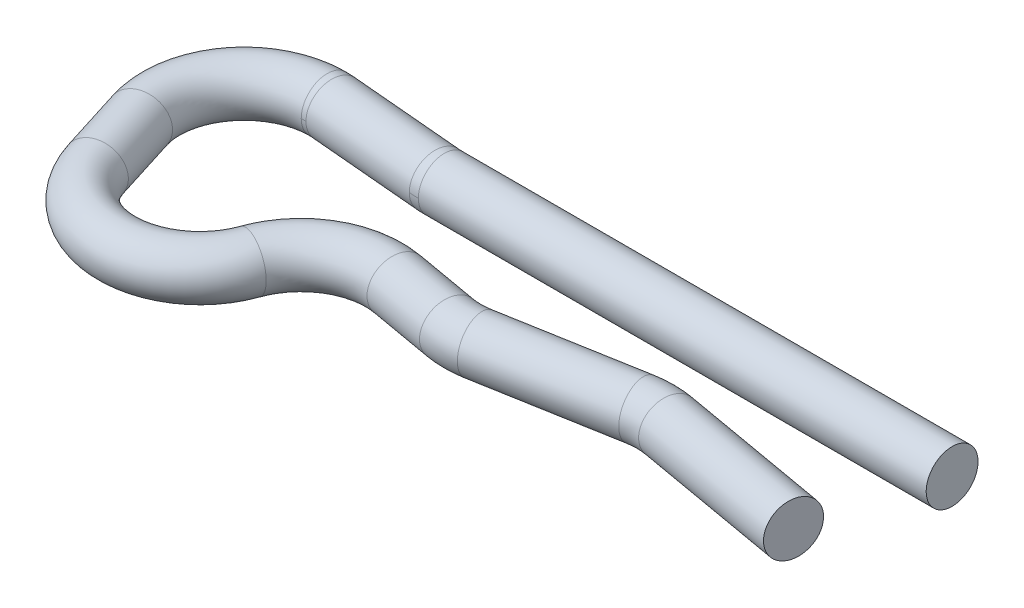
ISO-10303-21;
HEADER;
FILE_DESCRIPTION(('STEP AP214'),'2;1');
FILE_NAME('part.step','',(''),(''),'','','');
FILE_SCHEMA(('AUTOMOTIVE_DESIGN { 1 0 10303 214 1 1 1 1 }'));
ENDSEC;
DATA;
#1=APPLICATION_CONTEXT('core data for automotive mechanical design processes');
#2=APPLICATION_PROTOCOL_DEFINITION('international standard','automotive_design',2000,#1);
#3=PRODUCT_CONTEXT('',#1,'mechanical');
#4=PRODUCT('Part','Part','',(#3));
#5=PRODUCT_RELATED_PRODUCT_CATEGORY('part','',(#4));
#6=PRODUCT_DEFINITION_FORMATION('','',#4);
#7=PRODUCT_DEFINITION_CONTEXT('part definition',#1,'design');
#8=PRODUCT_DEFINITION('design','',#6,#7);
#9=PRODUCT_DEFINITION_SHAPE('','',#8);
#10=(LENGTH_UNIT() NAMED_UNIT(*) SI_UNIT(.MILLI.,.METRE.));
#11=(NAMED_UNIT(*) PLANE_ANGLE_UNIT() SI_UNIT($,.RADIAN.));
#12=(NAMED_UNIT(*) SI_UNIT($,.STERADIAN.) SOLID_ANGLE_UNIT());
#13=UNCERTAINTY_MEASURE_WITH_UNIT(LENGTH_MEASURE(1.E-05),#10,'distance_accuracy_value','');
#14=(GEOMETRIC_REPRESENTATION_CONTEXT(3) GLOBAL_UNCERTAINTY_ASSIGNED_CONTEXT((#13)) GLOBAL_UNIT_ASSIGNED_CONTEXT((#10,
#11,#12)) REPRESENTATION_CONTEXT('',''));
#15=CARTESIAN_POINT('',(0.,0.,0.));
#16=DIRECTION('',(0.,0.,1.));
#17=DIRECTION('',(1.,0.,0.));
#18=AXIS2_PLACEMENT_3D('',#15,#16,#17);
#19=CARTESIAN_POINT('',(-45.546720168648,-12.5000000003638,159.218937459353));
#20=DIRECTION('',(7.87396112827103E-12,-1.,-1.83559952871063E-10));
#21=DIRECTION('',(0.,1.83559952871063E-10,-1.));
#22=AXIS2_PLACEMENT_3D('',#19,#20,#21);
#23=TOROIDAL_SURFACE('',#22,2.00000000150892,0.625000000000209);
#24=CARTESIAN_POINT('',(-45.5467201685893,-12.4999999999966,159.218937457845));
#25=DIRECTION('',(0.,-1.,0.));
#26=DIRECTION('',(0.,0.,-1.));
#27=AXIS2_PLACEMENT_3D('',#24,#25,#26);
#28=CIRCLE('',#27,1.37500000000002);
#29=CARTESIAN_POINT('',(-45.5467201685893,-12.4999999999966,157.843937457845));
#30=VERTEX_POINT('',#29);
#31=CARTESIAN_POINT('',(-45.4268810223112,-12.4999999999966,157.849169747969));
#32=VERTEX_POINT('',#31);
#33=EDGE_CURVE('E34',#30,#32,#28,.T.);
#34=ORIENTED_EDGE('',*,*,#33,.F.);
#35=CARTESIAN_POINT('',(-45.5467201685893,-12.4999999999966,157.218937457845));
#36=DIRECTION('',(1.,0.,0.));
#37=DIRECTION('',(0.,1.,0.));
#38=AXIS2_PLACEMENT_3D('',#35,#36,#37);
#39=CIRCLE('',#38,0.624999999999987);
#40=CARTESIAN_POINT('',(-45.5467201685893,-12.4999999999966,156.593937457845));
#41=VERTEX_POINT('',#40);
#42=EDGE_CURVE('E11',#30,#41,#39,.T.);
#43=ORIENTED_EDGE('',*,*,#42,.T.);
#44=CARTESIAN_POINT('',(-45.5467201685893,-12.4999999999966,159.218937457845));
#45=DIRECTION('',(0.,-1.,0.));
#46=DIRECTION('',(0.,0.,-1.));
#47=AXIS2_PLACEMENT_3D('',#44,#45,#46);
#48=CIRCLE('',#47,2.62499999999999);
#49=CARTESIAN_POINT('',(-45.3179363438767,-12.4999999999966,156.603926375354));
#50=VERTEX_POINT('',#49);
#51=EDGE_CURVE('E26',#41,#50,#48,.T.);
#52=ORIENTED_EDGE('',*,*,#51,.T.);
#53=CARTESIAN_POINT('',(-45.372408683094,-12.4999999999966,157.226548061661));
#54=DIRECTION('',(0.996194698091746,0.,0.0871557427476577));
#55=DIRECTION('',(0.,-1.,0.));
#56=AXIS2_PLACEMENT_3D('',#53,#54,#55);
#57=CIRCLE('',#56,0.624999999999993);
#58=EDGE_CURVE('E101',#32,#50,#57,.T.);
#59=ORIENTED_EDGE('',*,*,#58,.F.);
#60=EDGE_LOOP('',(#34,#43,#52,#59));
#61=FACE_BOUND('',#60,.T.);
#62=ADVANCED_FACE('F16',(#61),#23,.T.);
#63=CARTESIAN_POINT('',(-45.5467201688116,-12.5000000015029,159.218937463478));
#64=DIRECTION('',(3.27591437518132E-11,-1.,-7.52985718310401E-10));
#65=DIRECTION('',(0.,7.52985718310401E-10,-1.));
#66=AXIS2_PLACEMENT_3D('',#63,#64,#65);
#67=TOROIDAL_SURFACE('',#66,2.00000000563584,0.624999999999183);
#68=ORIENTED_EDGE('',*,*,#51,.F.);
#69=CARTESIAN_POINT('',(-45.5467201685893,-12.4999999999966,157.218937457845));
#70=DIRECTION('',(1.,0.,0.));
#71=DIRECTION('',(0.,1.,0.));
#72=AXIS2_PLACEMENT_3D('',#69,#70,#71);
#73=CIRCLE('',#72,0.624999999999987);
#74=EDGE_CURVE('E109',#41,#30,#73,.T.);
#75=ORIENTED_EDGE('',*,*,#74,.T.);
#76=ORIENTED_EDGE('',*,*,#33,.T.);
#77=CARTESIAN_POINT('',(-45.372408683094,-12.4999999999966,157.226548061661));
#78=DIRECTION('',(0.996194698091746,0.,0.0871557427476577));
#79=DIRECTION('',(0.,-1.,0.));
#80=AXIS2_PLACEMENT_3D('',#77,#78,#79);
#81=CIRCLE('',#80,0.624999999999993);
#82=EDGE_CURVE('E105',#50,#32,#81,.T.);
#83=ORIENTED_EDGE('',*,*,#82,.F.);
#84=EDGE_LOOP('',(#68,#75,#76,#83));
#85=FACE_BOUND('',#84,.T.);
#86=ADVANCED_FACE('F117',(#85),#67,.T.);
#87=CARTESIAN_POINT('',(-42.4708141889227,-12.500000002278,155.472765019879));
#88=DIRECTION('',(4.99192310586111E-11,1.,-1.14040538910799E-09));
#89=DIRECTION('',(-0.999043326616076,0.,-0.0437313565292076));
#90=AXIS2_PLACEMENT_3D('',#87,#88,#89);
#91=TOROIDAL_SURFACE('',#90,1.99999999111517,0.625000000001191);
#92=CARTESIAN_POINT('',(-42.6451256739924,-12.4999999999966,157.465154407185));
#93=DIRECTION('',(0.996194698091745,0.,0.0871557427476617));
#94=DIRECTION('',(0.,-1.,0.));
#95=AXIS2_PLACEMENT_3D('',#92,#93,#94);
#96=CIRCLE('',#95,0.624999999999993);
#97=CARTESIAN_POINT('',(-42.6995980132096,-12.4999999999966,158.087776093492));
#98=VERTEX_POINT('',#97);
#99=CARTESIAN_POINT('',(-42.5906533347751,-12.4999999999966,156.842532720877));
#100=VERTEX_POINT('',#99);
#101=EDGE_CURVE('E104',#98,#100,#96,.T.);
#102=ORIENTED_EDGE('',*,*,#101,.T.);
#103=CARTESIAN_POINT('',(-42.470814188497,-12.4999999999966,155.472765011001));
#104=DIRECTION('',(0.,1.,0.));
#105=DIRECTION('',(1.,0.,0.));
#106=AXIS2_PLACEMENT_3D('',#103,#104,#105);
#107=CIRCLE('',#106,1.37500000000002);
#108=CARTESIAN_POINT('',(-42.470814188497,-12.4999999999966,156.847765011001));
#109=VERTEX_POINT('',#108);
#110=EDGE_CURVE('E70',#100,#109,#107,.T.);
#111=ORIENTED_EDGE('',*,*,#110,.T.);
#112=CARTESIAN_POINT('',(-42.470814188497,-12.4999999999966,157.472765011001));
#113=DIRECTION('',(1.,0.,0.));
#114=DIRECTION('',(0.,1.,0.));
#115=AXIS2_PLACEMENT_3D('',#112,#113,#114);
#116=CIRCLE('',#115,0.624999999999987);
#117=CARTESIAN_POINT('',(-42.470814188497,-12.4999999999966,158.097765011001));
#118=VERTEX_POINT('',#117);
#119=EDGE_CURVE('E54',#118,#109,#116,.T.);
#120=ORIENTED_EDGE('',*,*,#119,.F.);
#121=CARTESIAN_POINT('',(-42.470814188497,-12.4999999999966,155.472765011001));
#122=DIRECTION('',(0.,1.,0.));
#123=DIRECTION('',(1.,0.,0.));
#124=AXIS2_PLACEMENT_3D('',#121,#122,#123);
#125=CIRCLE('',#124,2.62499999999999);
#126=EDGE_CURVE('E60',#98,#118,#125,.T.);
#127=ORIENTED_EDGE('',*,*,#126,.F.);
#128=EDGE_LOOP('',(#102,#111,#120,#127));
#129=FACE_BOUND('',#128,.T.);
#130=ADVANCED_FACE('F69',(#129),#91,.T.);
#131=CARTESIAN_POINT('',(-42.6451256739924,-12.4999999999966,157.465154407185));
#132=DIRECTION('',(0.996194698091746,0.,0.0871557427476577));
#133=DIRECTION('',(0.,-1.,0.));
#134=AXIS2_PLACEMENT_3D('',#131,#132,#133);
#135=CYLINDRICAL_SURFACE('',#134,0.624999999999993);
#136=ORIENTED_EDGE('',*,*,#82,.T.);
#137=ORIENTED_EDGE('',*,*,#58,.T.);
#138=EDGE_LOOP('',(#136,#137));
#139=FACE_BOUND('',#138,.T.);
#140=ORIENTED_EDGE('',*,*,#101,.F.);
#141=CARTESIAN_POINT('',(-42.6451256739924,-12.4999999999966,157.465154407185));
#142=DIRECTION('',(0.996194698091745,0.,0.0871557427476617));
#143=DIRECTION('',(0.,-1.,0.));
#144=AXIS2_PLACEMENT_3D('',#141,#142,#143);
#145=CIRCLE('',#144,0.624999999999993);
#146=EDGE_CURVE('E64',#100,#98,#145,.T.);
#147=ORIENTED_EDGE('',*,*,#146,.F.);
#148=EDGE_LOOP('',(#140,#147));
#149=FACE_BOUND('',#148,.T.);
#150=ADVANCED_FACE('F120',(#139,#149),#135,.T.);
#151=CARTESIAN_POINT('',(-45.5467201685896,-12.4999999999966,159.218937457845));
#152=DIRECTION('',(0.,-1.,0.));
#153=DIRECTION('',(0.,0.,-1.));
#154=AXIS2_PLACEMENT_3D('',#151,#152,#153);
#155=TOROIDAL_SURFACE('',#154,1.99999999999974,0.625000000000017);
#156=ORIENTED_EDGE('',*,*,#74,.F.);
#157=ORIENTED_EDGE('',*,*,#42,.F.);
#158=EDGE_LOOP('',(#156,#157));
#159=FACE_BOUND('',#158,.T.);
#160=CARTESIAN_POINT('',(-47.454623892858,-12.4999999999966,159.818856934876));
#161=DIRECTION('',(-0.299959738515608,0.,-0.953951862134378));
#162=DIRECTION('',(-0.953951862134378,0.,0.299959738515608));
#163=AXIS2_PLACEMENT_3D('',#160,#161,#162);
#164=CIRCLE('',#163,0.625000000000001);
#165=CARTESIAN_POINT('',(-48.050843806692,-12.4999999999966,160.006331771448));
#166=VERTEX_POINT('',#165);
#167=EDGE_CURVE('E98',#166,#166,#164,.T.);
#168=ORIENTED_EDGE('',*,*,#167,.T.);
#169=EDGE_LOOP('',(#168));
#170=FACE_BOUND('',#169,.T.);
#171=ADVANCED_FACE('F123',(#159,#170),#155,.T.);
#172=CARTESIAN_POINT('',(-47.454623892858,-12.4999999999966,159.818856934876));
#173=DIRECTION('',(-0.299959738515604,0.,-0.95395186213438));
#174=DIRECTION('',(-0.95395186213438,0.,0.299959738515604));
#175=AXIS2_PLACEMENT_3D('',#172,#173,#174);
#176=CYLINDRICAL_SURFACE('',#175,0.625000000000001);
#177=CARTESIAN_POINT('',(-46.9660397985828,-12.4999999999966,161.372684488032));
#178=DIRECTION('',(-0.299959738515604,0.,-0.95395186213438));
#179=DIRECTION('',(-0.95395186213438,0.,0.299959738515604));
#180=AXIS2_PLACEMENT_3D('',#177,#178,#179);
#181=CIRCLE('',#180,0.625000000000001);
#182=CARTESIAN_POINT('',(-47.5622597124169,-12.4999999999966,161.560159324605));
#183=VERTEX_POINT('',#182);
#184=EDGE_CURVE('E95',#183,#183,#181,.T.);
#185=ORIENTED_EDGE('',*,*,#184,.T.);
#186=EDGE_LOOP('',(#185));
#187=FACE_BOUND('',#186,.T.);
#188=ORIENTED_EDGE('',*,*,#167,.F.);
#189=EDGE_LOOP('',(#188));
#190=FACE_BOUND('',#189,.T.);
#191=ADVANCED_FACE('F126',(#187,#190),#176,.T.);
#192=CARTESIAN_POINT('',(-45.0581360743141,-12.4999999999966,160.772765011001));
#193=DIRECTION('',(0.,-1.,0.));
#194=DIRECTION('',(-1.,0.,0.));
#195=AXIS2_PLACEMENT_3D('',#192,#193,#194);
#196=TOROIDAL_SURFACE('',#195,2.00000000000015,0.624999999999956);
#197=CARTESIAN_POINT('',(-43.1732728550762,-12.4999999999966,161.441562921258));
#198=DIRECTION('',(-0.334398955128511,0.,0.942431609618947));
#199=DIRECTION('',(0.,1.,0.));
#200=AXIS2_PLACEMENT_3D('',#197,#198,#199);
#201=CIRCLE('',#200,0.624999999999995);
#202=CARTESIAN_POINT('',(-42.5842530990643,-12.4999999999966,161.650562268214));
#203=VERTEX_POINT('',#202);
#204=EDGE_CURVE('E92',#203,#203,#201,.T.);
#205=CARTESIAN_POINT('',(-45.0581360743141,-12.4999999999966,160.772765011001));
#206=DIRECTION('',(0.,-1.,0.));
#207=DIRECTION('',(-1.,0.,0.));
#208=AXIS2_PLACEMENT_3D('',#205,#206,#207);
#209=CIRCLE('',#208,2.62500000000011);
#210=EDGE_CURVE('',#203,#183,#209,.T.);
#211=ORIENTED_EDGE('',*,*,#204,.T.);
#212=ORIENTED_EDGE('',*,*,#184,.F.);
#213=ORIENTED_EDGE('',*,*,#210,.T.);
#214=ORIENTED_EDGE('',*,*,#210,.F.);
#215=EDGE_LOOP('',(#211,#213,#212,#214));
#216=FACE_BOUND('',#215,.T.);
#217=ADVANCED_FACE('F131',(#216),#196,.T.);
#218=CARTESIAN_POINT('',(-41.2884096358381,-12.4999999999969,162.110360831516));
#219=DIRECTION('',(0.,1.,1.43295246764835E-13));
#220=DIRECTION('',(1.,0.,0.));
#221=AXIS2_PLACEMENT_3D('',#218,#219,#220);
#222=TOROIDAL_SURFACE('',#221,2.00000000000037,0.62500000000002);
#223=CARTESIAN_POINT('',(-40.9411132805044,-12.4999999999966,160.140745325491));
#224=DIRECTION('',(-0.984807753012208,0.,-0.173648177666931));
#225=DIRECTION('',(-0.173648177666931,0.,0.984807753012208));
#226=AXIS2_PLACEMENT_3D('',#223,#224,#225);
#227=CIRCLE('',#226,0.625000000000006);
#228=CARTESIAN_POINT('',(-41.0496433915462,-12.4999999999966,160.756250171123));
#229=VERTEX_POINT('',#228);
#230=EDGE_CURVE('E89',#229,#229,#227,.T.);
#231=ORIENTED_EDGE('',*,*,#230,.T.);
#232=EDGE_LOOP('',(#231));
#233=FACE_BOUND('',#232,.T.);
#234=ORIENTED_EDGE('',*,*,#204,.F.);
#235=EDGE_LOOP('',(#234));
#236=FACE_BOUND('',#235,.T.);
#237=ADVANCED_FACE('F138',(#233,#236),#222,.T.);
#238=CARTESIAN_POINT('',(-40.9411132805044,-12.4999999999966,160.140745325491));
#239=DIRECTION('',(-0.984807753012208,0.,-0.173648177666931));
#240=DIRECTION('',(-0.173648177666931,0.,0.984807753012208));
#241=AXIS2_PLACEMENT_3D('',#238,#239,#240);
#242=CYLINDRICAL_SURFACE('',#241,0.625000000000006);
#243=CARTESIAN_POINT('',(-39.4054324296479,-12.4999999999966,160.411527293254));
#244=DIRECTION('',(-0.984807753012208,0.,-0.173648177666931));
#245=DIRECTION('',(-0.173648177666931,0.,0.984807753012208));
#246=AXIS2_PLACEMENT_3D('',#243,#244,#245);
#247=CIRCLE('',#246,0.625000000000006);
#248=CARTESIAN_POINT('',(-39.5139625406869,-12.4999999999937,161.027032138888));
#249=VERTEX_POINT('',#248);
#250=EDGE_CURVE('E86',#249,#249,#247,.T.);
#251=ORIENTED_EDGE('',*,*,#250,.T.);
#252=EDGE_LOOP('',(#251));
#253=FACE_BOUND('',#252,.T.);
#254=ORIENTED_EDGE('',*,*,#230,.F.);
#255=EDGE_LOOP('',(#254));
#256=FACE_BOUND('',#255,.T.);
#257=ADVANCED_FACE('F154',(#253,#256),#242,.T.);
#258=CARTESIAN_POINT('',(-39.058136074315,-12.5000000000058,158.44191178718));
#259=DIRECTION('',(0.,-1.,4.70401178579826E-12));
#260=DIRECTION('',(-1.,0.,0.));
#261=AXIS2_PLACEMENT_3D('',#258,#259,#260);
#262=TOROIDAL_SURFACE('',#261,2.00000000004957,0.624999999999852);
#263=CARTESIAN_POINT('',(-38.7108397189802,-12.4999999999966,160.411527293254));
#264=DIRECTION('',(-0.984807753012209,0.,0.173648177666923));
#265=DIRECTION('',(0.,1.,0.));
#266=AXIS2_PLACEMENT_3D('',#263,#264,#265);
#267=CIRCLE('',#266,0.625000000000005);
#268=CARTESIAN_POINT('',(-38.6023096079407,-12.4999999999937,161.027032138887));
#269=VERTEX_POINT('',#268);
#270=EDGE_CURVE('E83',#269,#269,#267,.T.);
#271=CARTESIAN_POINT('',(-39.058136074315,-12.5000000000058,158.44191178718));
#272=DIRECTION('',(0.,-1.,4.70401178579826E-12));
#273=DIRECTION('',(-1.,0.,0.));
#274=AXIS2_PLACEMENT_3D('',#271,#272,#273);
#275=CIRCLE('',#274,2.62500000004942);
#276=EDGE_CURVE('',#269,#249,#275,.T.);
#277=ORIENTED_EDGE('',*,*,#270,.T.);
#278=ORIENTED_EDGE('',*,*,#250,.F.);
#279=ORIENTED_EDGE('',*,*,#276,.T.);
#280=ORIENTED_EDGE('',*,*,#276,.F.);
#281=EDGE_LOOP('',(#277,#279,#278,#280));
#282=FACE_BOUND('',#281,.T.);
#283=ADVANCED_FACE('F156',(#282),#262,.T.);
#284=CARTESIAN_POINT('',(-38.7108397189802,-12.4999999999966,160.411527293254));
#285=DIRECTION('',(-0.984807753012208,0.,0.17364817766693));
#286=DIRECTION('',(0.,1.,0.));
#287=AXIS2_PLACEMENT_3D('',#284,#285,#286);
#288=CYLINDRICAL_SURFACE('',#287,0.625000000000006);
#289=CARTESIAN_POINT('',(-35.4054324296479,-12.4999999999966,159.828694805914));
#290=DIRECTION('',(-0.984807753012208,0.,0.17364817766693));
#291=DIRECTION('',(0.,1.,0.));
#292=AXIS2_PLACEMENT_3D('',#289,#290,#291);
#293=CIRCLE('',#292,0.625000000000006);
#294=CARTESIAN_POINT('',(-35.5139625406926,-12.4999999999926,159.213189960283));
#295=VERTEX_POINT('',#294);
#296=EDGE_CURVE('E80',#295,#295,#293,.T.);
#297=ORIENTED_EDGE('',*,*,#296,.T.);
#298=EDGE_LOOP('',(#297));
#299=FACE_BOUND('',#298,.T.);
#300=ORIENTED_EDGE('',*,*,#270,.F.);
#301=EDGE_LOOP('',(#300));
#302=FACE_BOUND('',#301,.T.);
#303=ADVANCED_FACE('F159',(#299,#302),#288,.T.);
#304=CARTESIAN_POINT('',(-35.0581360743133,-12.5000000000094,161.798310311889));
#305=DIRECTION('',(0.,1.,6.47985280748501E-12));
#306=DIRECTION('',(1.,0.,0.));
#307=AXIS2_PLACEMENT_3D('',#304,#305,#306);
#308=TOROIDAL_SURFACE('',#307,1.99999999995016,0.625000000000149);
#309=CARTESIAN_POINT('',(-34.7108397189802,-12.4999999999966,159.828694805914));
#310=DIRECTION('',(-0.984807753012209,0.,-0.173648177666924));
#311=DIRECTION('',(-0.173648177666924,0.,0.984807753012209));
#312=AXIS2_PLACEMENT_3D('',#309,#310,#311);
#313=CIRCLE('',#312,0.625000000000005);
#314=CARTESIAN_POINT('',(-34.602309607936,-12.4999999999926,159.213189960282));
#315=VERTEX_POINT('',#314);
#316=EDGE_CURVE('E75',#315,#315,#313,.T.);
#317=CARTESIAN_POINT('',(-35.0581360743133,-12.5000000000094,161.798310311889));
#318=DIRECTION('',(0.,1.,6.47985280748501E-12));
#319=DIRECTION('',(1.,0.,0.));
#320=AXIS2_PLACEMENT_3D('',#317,#318,#319);
#321=CIRCLE('',#320,2.62499999995031);
#322=EDGE_CURVE('',#315,#295,#321,.T.);
#323=ORIENTED_EDGE('',*,*,#316,.T.);
#324=ORIENTED_EDGE('',*,*,#296,.F.);
#325=ORIENTED_EDGE('',*,*,#322,.T.);
#326=ORIENTED_EDGE('',*,*,#322,.F.);
#327=EDGE_LOOP('',(#323,#325,#324,#326));
#328=FACE_BOUND('',#327,.T.);
#329=ADVANCED_FACE('F161',(#328),#308,.T.);
#330=CARTESIAN_POINT('',(-34.7108397189802,-12.4999999999966,159.828694805914));
#331=DIRECTION('',(-0.984807753012208,0.,-0.17364817766693));
#332=DIRECTION('',(-0.17364817766693,0.,0.984807753012208));
#333=AXIS2_PLACEMENT_3D('',#330,#331,#332);
#334=CYLINDRICAL_SURFACE('',#333,0.625000000000006);
#335=CARTESIAN_POINT('',(-31.0581360743141,-12.4999999999966,160.472765011001));
#336=DIRECTION('',(-0.984807753012208,0.,-0.17364817766693));
#337=DIRECTION('',(-0.17364817766693,0.,0.984807753012208));
#338=AXIS2_PLACEMENT_3D('',#335,#336,#337);
#339=CIRCLE('',#338,0.625000000000006);
#340=CARTESIAN_POINT('',(-31.1666661853559,-12.4999999999966,161.088269856634));
#341=VERTEX_POINT('',#340);
#342=EDGE_CURVE('E73',#341,#341,#339,.T.);
#343=ORIENTED_EDGE('',*,*,#342,.T.);
#344=EDGE_LOOP('',(#343));
#345=FACE_BOUND('',#344,.T.);
#346=ORIENTED_EDGE('',*,*,#316,.F.);
#347=EDGE_LOOP('',(#346));
#348=FACE_BOUND('',#347,.T.);
#349=ADVANCED_FACE('F164',(#345,#348),#334,.T.);
#350=CARTESIAN_POINT('',(-28.5581360743141,-12.4999999999966,157.472765011001));
#351=DIRECTION('',(1.,0.,0.));
#352=DIRECTION('',(0.,1.,0.));
#353=AXIS2_PLACEMENT_3D('',#350,#351,#352);
#354=CYLINDRICAL_SURFACE('',#353,0.624999999999987);
#355=CARTESIAN_POINT('',(-42.470814188497,-12.4999999999966,157.472765011001));
#356=DIRECTION('',(1.,0.,0.));
#357=DIRECTION('',(0.,1.,0.));
#358=AXIS2_PLACEMENT_3D('',#355,#356,#357);
#359=CIRCLE('',#358,0.624999999999987);
#360=EDGE_CURVE('E62',#109,#118,#359,.T.);
#361=ORIENTED_EDGE('',*,*,#360,.T.);
#362=ORIENTED_EDGE('',*,*,#119,.T.);
#363=EDGE_LOOP('',(#361,#362));
#364=FACE_BOUND('',#363,.T.);
#365=CARTESIAN_POINT('',(-30.2377523917796,-12.4999999999966,157.472765011001));
#366=DIRECTION('',(-1.,0.,0.));
#367=DIRECTION('',(0.,0.,1.));
#368=AXIS2_PLACEMENT_3D('',#365,#366,#367);
#369=CIRCLE('',#368,0.624999999999987);
#370=CARTESIAN_POINT('',(-30.2377523917796,-12.4999999999966,158.097765011001));
#371=VERTEX_POINT('',#370);
#372=EDGE_CURVE('E20',#371,#371,#369,.T.);
#373=ORIENTED_EDGE('',*,*,#372,.T.);
#374=EDGE_LOOP('',(#373));
#375=FACE_BOUND('',#374,.T.);
#376=ADVANCED_FACE('F18',(#364,#375),#354,.T.);
#377=CARTESIAN_POINT('',(-31.0581360743141,-12.4999999999966,160.472765011001));
#378=DIRECTION('',(-0.984807753012208,0.,-0.17364817766693));
#379=DIRECTION('',(-0.17364817766693,0.,0.984807753012208));
#380=AXIS2_PLACEMENT_3D('',#377,#378,#379);
#381=PLANE('',#380);
#382=ORIENTED_EDGE('',*,*,#342,.F.);
#383=EDGE_LOOP('',(#382));
#384=FACE_BOUND('',#383,.T.);
#385=ADVANCED_FACE('F166',(#384),#381,.F.);
#386=CARTESIAN_POINT('',(-42.4708141885707,-12.500000000392,155.472765012551));
#387=DIRECTION('',(8.6922644742758E-12,1.,-1.97653732100154E-10));
#388=DIRECTION('',(-0.999034401807047,0.,-0.0439347698985342));
#389=AXIS2_PLACEMENT_3D('',#386,#387,#388);
#390=TOROIDAL_SURFACE('',#389,1.99999999844866,0.624999999999736);
#391=ORIENTED_EDGE('',*,*,#110,.F.);
#392=ORIENTED_EDGE('',*,*,#146,.T.);
#393=ORIENTED_EDGE('',*,*,#126,.T.);
#394=ORIENTED_EDGE('',*,*,#360,.F.);
#395=EDGE_LOOP('',(#391,#392,#393,#394));
#396=FACE_BOUND('',#395,.T.);
#397=ADVANCED_FACE('F61',(#396),#390,.T.);
#398=CARTESIAN_POINT('',(-30.2377523917796,-12.5946020455283,163.397765011001));
#399=DIRECTION('',(1.,0.,0.));
#400=DIRECTION('',(0.,0.,-1.));
#401=AXIS2_PLACEMENT_3D('',#398,#399,#400);
#402=PLANE('',#401);
#403=ORIENTED_EDGE('',*,*,#372,.F.);
#404=EDGE_LOOP('',(#403));
#405=FACE_BOUND('',#404,.T.);
#406=ADVANCED_FACE('F171',(#405),#402,.T.);
#407=CLOSED_SHELL('',(#62,#86,#130,#150,#171,#191,#217,#237,#257,#283,#303,#329,#349,#376,#385,
#397,#406));
#408=MANIFOLD_SOLID_BREP('B1',#407);
#409=ADVANCED_BREP_SHAPE_REPRESENTATION('',(#18,#408),#14);
#410=SHAPE_DEFINITION_REPRESENTATION(#9,#409);
ENDSEC;
END-ISO-10303-21;
